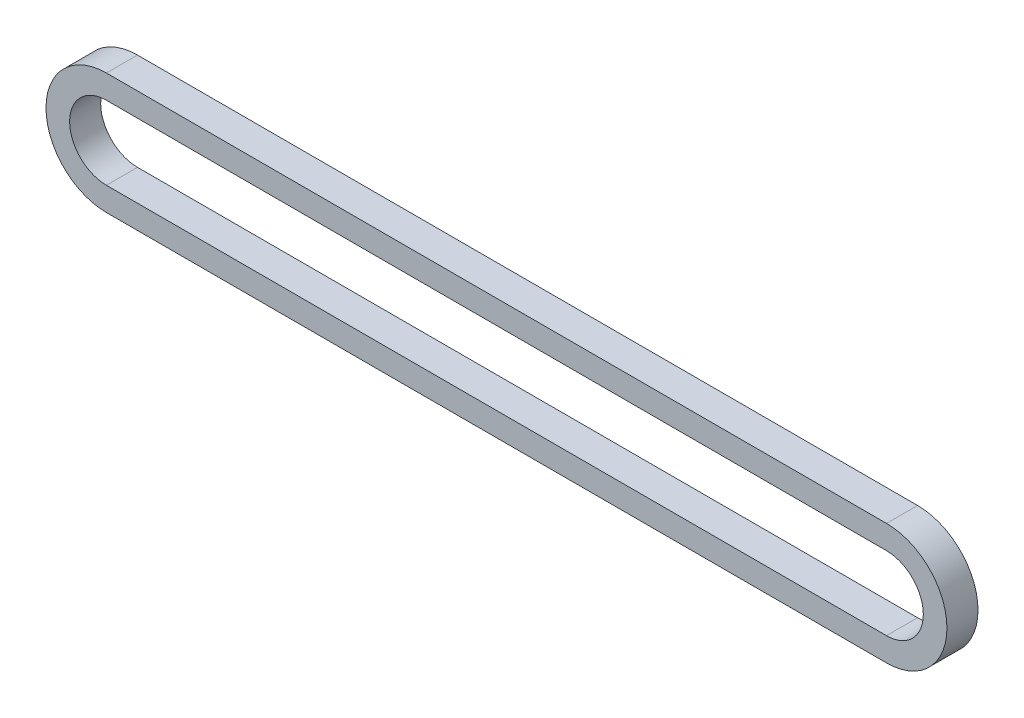
ISO-10303-21;
HEADER;
FILE_DESCRIPTION(('STEP AP214'),'2;1');
FILE_NAME('part.step','',(''),(''),'','','');
FILE_SCHEMA(('AUTOMOTIVE_DESIGN { 1 0 10303 214 1 1 1 1 }'));
ENDSEC;
DATA;
#1=APPLICATION_CONTEXT('core data for automotive mechanical design processes');
#2=APPLICATION_PROTOCOL_DEFINITION('international standard','automotive_design',2000,#1);
#3=PRODUCT_CONTEXT('',#1,'mechanical');
#4=PRODUCT('Part','Part','',(#3));
#5=PRODUCT_RELATED_PRODUCT_CATEGORY('part','',(#4));
#6=PRODUCT_DEFINITION_FORMATION('','',#4);
#7=PRODUCT_DEFINITION_CONTEXT('part definition',#1,'design');
#8=PRODUCT_DEFINITION('design','',#6,#7);
#9=PRODUCT_DEFINITION_SHAPE('','',#8);
#10=(LENGTH_UNIT() NAMED_UNIT(*) SI_UNIT(.MILLI.,.METRE.));
#11=(NAMED_UNIT(*) PLANE_ANGLE_UNIT() SI_UNIT($,.RADIAN.));
#12=(NAMED_UNIT(*) SI_UNIT($,.STERADIAN.) SOLID_ANGLE_UNIT());
#13=UNCERTAINTY_MEASURE_WITH_UNIT(LENGTH_MEASURE(1.E-05),#10,'distance_accuracy_value','');
#14=(GEOMETRIC_REPRESENTATION_CONTEXT(3) GLOBAL_UNCERTAINTY_ASSIGNED_CONTEXT((#13)) GLOBAL_UNIT_ASSIGNED_CONTEXT((#10,
#11,#12)) REPRESENTATION_CONTEXT('',''));
#15=CARTESIAN_POINT('',(0.,0.,0.));
#16=DIRECTION('',(0.,0.,1.));
#17=DIRECTION('',(1.,0.,0.));
#18=AXIS2_PLACEMENT_3D('',#15,#16,#17);
#19=CARTESIAN_POINT('',(0.,0.,5.8801));
#20=DIRECTION('',(0.,0.,1.));
#21=DIRECTION('',(1.,0.,0.));
#22=AXIS2_PLACEMENT_3D('',#19,#20,#21);
#23=PLANE('',#22);
#24=CARTESIAN_POINT('',(0.,0.,5.8801));
#25=DIRECTION('',(0.,0.,1.));
#26=DIRECTION('',(1.,0.,0.));
#27=AXIS2_PLACEMENT_3D('',#24,#25,#26);
#28=CIRCLE('',#27,22.8712869908068);
#29=CARTESIAN_POINT('',(0.,22.8712869908068,5.8801));
#30=VERTEX_POINT('',#29);
#31=CARTESIAN_POINT('',(0.,-22.8712869908068,5.8801));
#32=VERTEX_POINT('',#31);
#33=EDGE_CURVE('E157',#30,#32,#28,.T.);
#34=ORIENTED_EDGE('',*,*,#33,.T.);
#35=DIRECTION('',(1.,0.,0.));
#36=VECTOR('',#35,1.);
#37=CARTESIAN_POINT('',(0.,-22.8712869908068,5.8801));
#38=LINE('',#37,#36);
#39=CARTESIAN_POINT('',(295.275,-22.8712869908068,5.8801));
#40=VERTEX_POINT('',#39);
#41=EDGE_CURVE('E160',#32,#40,#38,.T.);
#42=ORIENTED_EDGE('',*,*,#41,.T.);
#43=CARTESIAN_POINT('',(295.275,0.,5.8801));
#44=DIRECTION('',(0.,0.,1.));
#45=DIRECTION('',(1.,0.,0.));
#46=AXIS2_PLACEMENT_3D('',#43,#44,#45);
#47=CIRCLE('',#46,22.8712869908068);
#48=CARTESIAN_POINT('',(295.275,22.8712869908068,5.8801));
#49=VERTEX_POINT('',#48);
#50=EDGE_CURVE('E163',#40,#49,#47,.T.);
#51=ORIENTED_EDGE('',*,*,#50,.T.);
#52=DIRECTION('',(-1.,0.,0.));
#53=VECTOR('',#52,1.);
#54=CARTESIAN_POINT('',(0.,22.8712869908068,5.8801));
#55=LINE('',#54,#53);
#56=EDGE_CURVE('E165',#49,#30,#55,.T.);
#57=ORIENTED_EDGE('',*,*,#56,.T.);
#58=EDGE_LOOP('',(#34,#42,#51,#57));
#59=FACE_BOUND('',#58,.T.);
#60=DIRECTION('',(1.,0.,0.));
#61=VECTOR('',#60,1.);
#62=CARTESIAN_POINT('',(0.,-13.9304869908068,5.8801));
#63=LINE('',#62,#61);
#64=CARTESIAN_POINT('',(0.,-13.9304869908068,5.8801));
#65=VERTEX_POINT('',#64);
#66=CARTESIAN_POINT('',(295.275,-13.9304869908068,5.8801));
#67=VERTEX_POINT('',#66);
#68=EDGE_CURVE('E129',#65,#67,#63,.T.);
#69=ORIENTED_EDGE('',*,*,#68,.F.);
#70=CARTESIAN_POINT('',(0.,0.,5.8801));
#71=DIRECTION('',(0.,0.,1.));
#72=DIRECTION('',(1.,0.,0.));
#73=AXIS2_PLACEMENT_3D('',#70,#71,#72);
#74=CIRCLE('',#73,13.9304869908068);
#75=CARTESIAN_POINT('',(0.,13.9304869908068,5.8801));
#76=VERTEX_POINT('',#75);
#77=EDGE_CURVE('E121',#76,#65,#74,.T.);
#78=ORIENTED_EDGE('',*,*,#77,.F.);
#79=DIRECTION('',(-1.,0.,0.));
#80=VECTOR('',#79,1.);
#81=CARTESIAN_POINT('',(0.,13.9304869908068,5.8801));
#82=LINE('',#81,#80);
#83=CARTESIAN_POINT('',(295.275,13.9304869908068,5.8801));
#84=VERTEX_POINT('',#83);
#85=EDGE_CURVE('E143',#84,#76,#82,.T.);
#86=ORIENTED_EDGE('',*,*,#85,.F.);
#87=CARTESIAN_POINT('',(295.275,0.,5.8801));
#88=DIRECTION('',(0.,0.,1.));
#89=DIRECTION('',(1.,0.,0.));
#90=AXIS2_PLACEMENT_3D('',#87,#88,#89);
#91=CIRCLE('',#90,13.9304869908068);
#92=EDGE_CURVE('E141',#67,#84,#91,.T.);
#93=ORIENTED_EDGE('',*,*,#92,.F.);
#94=EDGE_LOOP('',(#69,#78,#86,#93));
#95=FACE_BOUND('',#94,.T.);
#96=ADVANCED_FACE('F56',(#59,#95),#23,.T.);
#97=CARTESIAN_POINT('',(0.,0.,-5.8801));
#98=DIRECTION('',(0.,0.,1.));
#99=DIRECTION('',(1.,0.,0.));
#100=AXIS2_PLACEMENT_3D('',#97,#98,#99);
#101=PLANE('',#100);
#102=CARTESIAN_POINT('',(0.,0.,-5.8801));
#103=DIRECTION('',(0.,0.,1.));
#104=DIRECTION('',(1.,0.,0.));
#105=AXIS2_PLACEMENT_3D('',#102,#103,#104);
#106=CIRCLE('',#105,22.8712869908068);
#107=CARTESIAN_POINT('',(0.,22.8712869908068,-5.8801));
#108=VERTEX_POINT('',#107);
#109=CARTESIAN_POINT('',(0.,-22.8712869908068,-5.8801));
#110=VERTEX_POINT('',#109);
#111=EDGE_CURVE('E137',#108,#110,#106,.T.);
#112=ORIENTED_EDGE('',*,*,#111,.F.);
#113=DIRECTION('',(-1.,0.,0.));
#114=VECTOR('',#113,1.);
#115=CARTESIAN_POINT('',(0.,22.8712869908068,-5.8801));
#116=LINE('',#115,#114);
#117=CARTESIAN_POINT('',(295.275,22.8712869908068,-5.8801));
#118=VERTEX_POINT('',#117);
#119=EDGE_CURVE('E161',#118,#108,#116,.T.);
#120=ORIENTED_EDGE('',*,*,#119,.F.);
#121=CARTESIAN_POINT('',(295.275,0.,-5.8801));
#122=DIRECTION('',(0.,0.,1.));
#123=DIRECTION('',(1.,0.,0.));
#124=AXIS2_PLACEMENT_3D('',#121,#122,#123);
#125=CIRCLE('',#124,22.8712869908068);
#126=CARTESIAN_POINT('',(295.275,-22.8712869908068,-5.8801));
#127=VERTEX_POINT('',#126);
#128=EDGE_CURVE('E172',#127,#118,#125,.T.);
#129=ORIENTED_EDGE('',*,*,#128,.F.);
#130=DIRECTION('',(1.,0.,0.));
#131=VECTOR('',#130,1.);
#132=CARTESIAN_POINT('',(0.,-22.8712869908068,-5.8801));
#133=LINE('',#132,#131);
#134=EDGE_CURVE('E170',#110,#127,#133,.T.);
#135=ORIENTED_EDGE('',*,*,#134,.F.);
#136=EDGE_LOOP('',(#112,#120,#129,#135));
#137=FACE_BOUND('',#136,.T.);
#138=CARTESIAN_POINT('',(0.,0.,-5.8801));
#139=DIRECTION('',(0.,0.,1.));
#140=DIRECTION('',(1.,0.,0.));
#141=AXIS2_PLACEMENT_3D('',#138,#139,#140);
#142=CIRCLE('',#141,13.9304869908068);
#143=CARTESIAN_POINT('',(0.,13.9304869908068,-5.8801));
#144=VERTEX_POINT('',#143);
#145=CARTESIAN_POINT('',(0.,-13.9304869908068,-5.8801));
#146=VERTEX_POINT('',#145);
#147=EDGE_CURVE('E79',#144,#146,#142,.T.);
#148=ORIENTED_EDGE('',*,*,#147,.T.);
#149=DIRECTION('',(1.,0.,0.));
#150=VECTOR('',#149,1.);
#151=CARTESIAN_POINT('',(0.,-13.9304869908068,-5.8801));
#152=LINE('',#151,#150);
#153=CARTESIAN_POINT('',(295.275,-13.9304869908068,-5.8801));
#154=VERTEX_POINT('',#153);
#155=EDGE_CURVE('E136',#146,#154,#152,.T.);
#156=ORIENTED_EDGE('',*,*,#155,.T.);
#157=CARTESIAN_POINT('',(295.275,0.,-5.8801));
#158=DIRECTION('',(0.,0.,1.));
#159=DIRECTION('',(1.,0.,0.));
#160=AXIS2_PLACEMENT_3D('',#157,#158,#159);
#161=CIRCLE('',#160,13.9304869908068);
#162=CARTESIAN_POINT('',(295.275,13.9304869908068,-5.8801));
#163=VERTEX_POINT('',#162);
#164=EDGE_CURVE('E149',#154,#163,#161,.T.);
#165=ORIENTED_EDGE('',*,*,#164,.T.);
#166=DIRECTION('',(-1.,0.,0.));
#167=VECTOR('',#166,1.);
#168=CARTESIAN_POINT('',(0.,13.9304869908068,-5.8801));
#169=LINE('',#168,#167);
#170=EDGE_CURVE('E130',#163,#144,#169,.T.);
#171=ORIENTED_EDGE('',*,*,#170,.T.);
#172=EDGE_LOOP('',(#148,#156,#165,#171));
#173=FACE_BOUND('',#172,.T.);
#174=ADVANCED_FACE('F190',(#137,#173),#101,.F.);
#175=CARTESIAN_POINT('',(0.,0.,5.8801));
#176=DIRECTION('',(0.,0.,-1.));
#177=DIRECTION('',(-1.,0.,0.));
#178=AXIS2_PLACEMENT_3D('',#175,#176,#177);
#179=CYLINDRICAL_SURFACE('',#178,22.8712869908068);
#180=ORIENTED_EDGE('',*,*,#111,.T.);
#181=DIRECTION('',(0.,0.,-1.));
#182=VECTOR('',#181,1.);
#183=CARTESIAN_POINT('',(0.,-22.8712869908068,5.8801));
#184=LINE('',#183,#182);
#185=EDGE_CURVE('E12',#32,#110,#184,.T.);
#186=ORIENTED_EDGE('',*,*,#185,.F.);
#187=ORIENTED_EDGE('',*,*,#33,.F.);
#188=DIRECTION('',(0.,0.,-1.));
#189=VECTOR('',#188,1.);
#190=CARTESIAN_POINT('',(0.,22.8712869908068,5.8801));
#191=LINE('',#190,#189);
#192=EDGE_CURVE('E167',#30,#108,#191,.T.);
#193=ORIENTED_EDGE('',*,*,#192,.T.);
#194=EDGE_LOOP('',(#180,#186,#187,#193));
#195=FACE_BOUND('',#194,.T.);
#196=ADVANCED_FACE('F58',(#195),#179,.T.);
#197=CARTESIAN_POINT('',(0.,-22.8712869908068,5.8801));
#198=DIRECTION('',(0.,1.,0.));
#199=DIRECTION('',(0.,0.,1.));
#200=AXIS2_PLACEMENT_3D('',#197,#198,#199);
#201=PLANE('',#200);
#202=ORIENTED_EDGE('',*,*,#134,.T.);
#203=DIRECTION('',(0.,0.,-1.));
#204=VECTOR('',#203,1.);
#205=CARTESIAN_POINT('',(295.275,-22.8712869908068,5.8801));
#206=LINE('',#205,#204);
#207=EDGE_CURVE('E64',#40,#127,#206,.T.);
#208=ORIENTED_EDGE('',*,*,#207,.F.);
#209=ORIENTED_EDGE('',*,*,#41,.F.);
#210=ORIENTED_EDGE('',*,*,#185,.T.);
#211=EDGE_LOOP('',(#202,#208,#209,#210));
#212=FACE_BOUND('',#211,.T.);
#213=ADVANCED_FACE('F200',(#212),#201,.F.);
#214=CARTESIAN_POINT('',(295.275,0.,5.8801));
#215=DIRECTION('',(0.,0.,-1.));
#216=DIRECTION('',(-1.,0.,0.));
#217=AXIS2_PLACEMENT_3D('',#214,#215,#216);
#218=CYLINDRICAL_SURFACE('',#217,22.8712869908068);
#219=ORIENTED_EDGE('',*,*,#128,.T.);
#220=DIRECTION('',(0.,0.,-1.));
#221=VECTOR('',#220,1.);
#222=CARTESIAN_POINT('',(295.275,22.8712869908068,5.8801));
#223=LINE('',#222,#221);
#224=EDGE_CURVE('E177',#49,#118,#223,.T.);
#225=ORIENTED_EDGE('',*,*,#224,.F.);
#226=ORIENTED_EDGE('',*,*,#50,.F.);
#227=ORIENTED_EDGE('',*,*,#207,.T.);
#228=EDGE_LOOP('',(#219,#225,#226,#227));
#229=FACE_BOUND('',#228,.T.);
#230=ADVANCED_FACE('F184',(#229),#218,.T.);
#231=CARTESIAN_POINT('',(0.,22.8712869908068,5.8801));
#232=DIRECTION('',(0.,-1.,0.));
#233=DIRECTION('',(0.,0.,-1.));
#234=AXIS2_PLACEMENT_3D('',#231,#232,#233);
#235=PLANE('',#234);
#236=ORIENTED_EDGE('',*,*,#119,.T.);
#237=ORIENTED_EDGE('',*,*,#192,.F.);
#238=ORIENTED_EDGE('',*,*,#56,.F.);
#239=ORIENTED_EDGE('',*,*,#224,.T.);
#240=EDGE_LOOP('',(#236,#237,#238,#239));
#241=FACE_BOUND('',#240,.T.);
#242=ADVANCED_FACE('F194',(#241),#235,.F.);
#243=CARTESIAN_POINT('',(0.,0.,5.8801));
#244=DIRECTION('',(0.,0.,-1.));
#245=DIRECTION('',(-1.,0.,0.));
#246=AXIS2_PLACEMENT_3D('',#243,#244,#245);
#247=CYLINDRICAL_SURFACE('',#246,13.9304869908068);
#248=ORIENTED_EDGE('',*,*,#147,.F.);
#249=DIRECTION('',(0.,0.,-1.));
#250=VECTOR('',#249,1.);
#251=CARTESIAN_POINT('',(0.,13.9304869908068,5.8801));
#252=LINE('',#251,#250);
#253=EDGE_CURVE('E125',#76,#144,#252,.T.);
#254=ORIENTED_EDGE('',*,*,#253,.F.);
#255=ORIENTED_EDGE('',*,*,#77,.T.);
#256=DIRECTION('',(0.,0.,-1.));
#257=VECTOR('',#256,1.);
#258=CARTESIAN_POINT('',(0.,-13.9304869908068,5.8801));
#259=LINE('',#258,#257);
#260=EDGE_CURVE('E124',#65,#146,#259,.T.);
#261=ORIENTED_EDGE('',*,*,#260,.T.);
#262=EDGE_LOOP('',(#248,#254,#255,#261));
#263=FACE_BOUND('',#262,.T.);
#264=ADVANCED_FACE('F123',(#263),#247,.F.);
#265=CARTESIAN_POINT('',(0.,-13.9304869908068,5.8801));
#266=DIRECTION('',(0.,1.,0.));
#267=DIRECTION('',(0.,0.,1.));
#268=AXIS2_PLACEMENT_3D('',#265,#266,#267);
#269=PLANE('',#268);
#270=ORIENTED_EDGE('',*,*,#155,.F.);
#271=ORIENTED_EDGE('',*,*,#260,.F.);
#272=ORIENTED_EDGE('',*,*,#68,.T.);
#273=DIRECTION('',(0.,0.,-1.));
#274=VECTOR('',#273,1.);
#275=CARTESIAN_POINT('',(295.275,-13.9304869908068,5.8801));
#276=LINE('',#275,#274);
#277=EDGE_CURVE('E138',#67,#154,#276,.T.);
#278=ORIENTED_EDGE('',*,*,#277,.T.);
#279=EDGE_LOOP('',(#270,#271,#272,#278));
#280=FACE_BOUND('',#279,.T.);
#281=ADVANCED_FACE('F133',(#280),#269,.T.);
#282=CARTESIAN_POINT('',(295.275,0.,5.8801));
#283=DIRECTION('',(0.,0.,-1.));
#284=DIRECTION('',(-1.,0.,0.));
#285=AXIS2_PLACEMENT_3D('',#282,#283,#284);
#286=CYLINDRICAL_SURFACE('',#285,13.9304869908068);
#287=ORIENTED_EDGE('',*,*,#164,.F.);
#288=ORIENTED_EDGE('',*,*,#277,.F.);
#289=ORIENTED_EDGE('',*,*,#92,.T.);
#290=DIRECTION('',(0.,0.,-1.));
#291=VECTOR('',#290,1.);
#292=CARTESIAN_POINT('',(295.275,13.9304869908068,5.8801));
#293=LINE('',#292,#291);
#294=EDGE_CURVE('E71',#84,#163,#293,.T.);
#295=ORIENTED_EDGE('',*,*,#294,.T.);
#296=EDGE_LOOP('',(#287,#288,#289,#295));
#297=FACE_BOUND('',#296,.T.);
#298=ADVANCED_FACE('F223',(#297),#286,.F.);
#299=CARTESIAN_POINT('',(0.,13.9304869908068,5.8801));
#300=DIRECTION('',(0.,-1.,0.));
#301=DIRECTION('',(0.,0.,-1.));
#302=AXIS2_PLACEMENT_3D('',#299,#300,#301);
#303=PLANE('',#302);
#304=ORIENTED_EDGE('',*,*,#170,.F.);
#305=ORIENTED_EDGE('',*,*,#294,.F.);
#306=ORIENTED_EDGE('',*,*,#85,.T.);
#307=ORIENTED_EDGE('',*,*,#253,.T.);
#308=EDGE_LOOP('',(#304,#305,#306,#307));
#309=FACE_BOUND('',#308,.T.);
#310=ADVANCED_FACE('F227',(#309),#303,.T.);
#311=CLOSED_SHELL('',(#96,#174,#196,#213,#230,#242,#264,#281,#298,#310));
#312=MANIFOLD_SOLID_BREP('B2',#311);
#313=ADVANCED_BREP_SHAPE_REPRESENTATION('',(#18,#312),#14);
#314=SHAPE_DEFINITION_REPRESENTATION(#9,#313);
ENDSEC;
END-ISO-10303-21;
